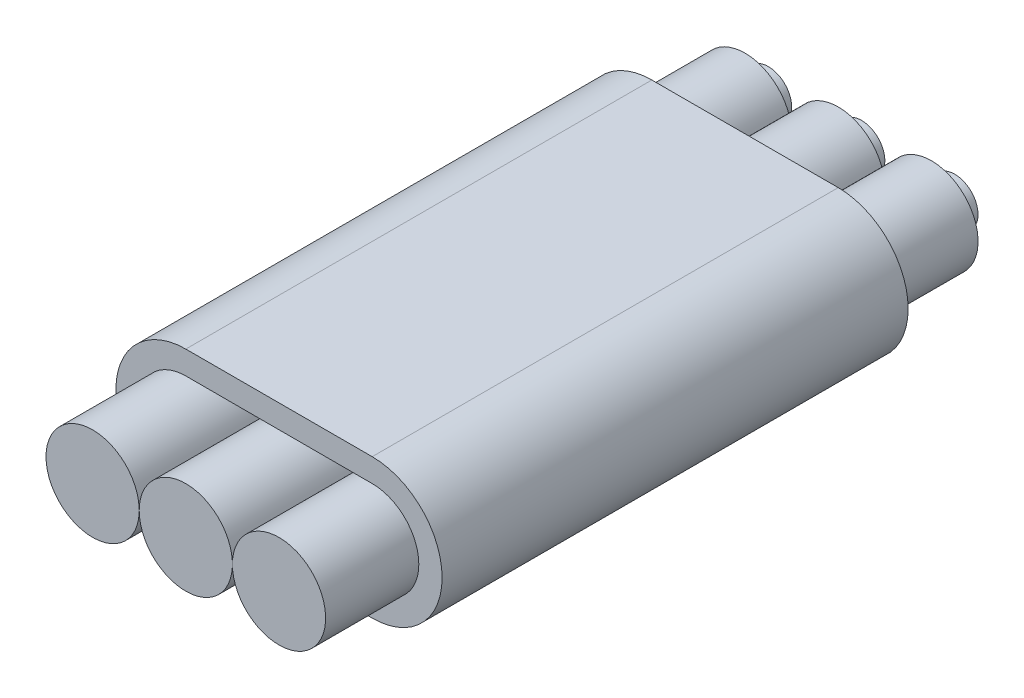
ISO-10303-21;
HEADER;
FILE_DESCRIPTION(('STEP AP214'),'2;1');
FILE_NAME('part.step','',(''),(''),'','','');
FILE_SCHEMA(('AUTOMOTIVE_DESIGN { 1 0 10303 214 1 1 1 1 }'));
ENDSEC;
DATA;
#1=APPLICATION_CONTEXT('core data for automotive mechanical design processes');
#2=APPLICATION_PROTOCOL_DEFINITION('international standard','automotive_design',2000,#1);
#3=PRODUCT_CONTEXT('',#1,'mechanical');
#4=PRODUCT('Part','Part','',(#3));
#5=PRODUCT_RELATED_PRODUCT_CATEGORY('part','',(#4));
#6=PRODUCT_DEFINITION_FORMATION('','',#4);
#7=PRODUCT_DEFINITION_CONTEXT('part definition',#1,'design');
#8=PRODUCT_DEFINITION('design','',#6,#7);
#9=PRODUCT_DEFINITION_SHAPE('','',#8);
#10=(LENGTH_UNIT() NAMED_UNIT(*) SI_UNIT(.MILLI.,.METRE.));
#11=(NAMED_UNIT(*) PLANE_ANGLE_UNIT() SI_UNIT($,.RADIAN.));
#12=(NAMED_UNIT(*) SI_UNIT($,.STERADIAN.) SOLID_ANGLE_UNIT());
#13=UNCERTAINTY_MEASURE_WITH_UNIT(LENGTH_MEASURE(1.E-05),#10,'distance_accuracy_value','');
#14=(GEOMETRIC_REPRESENTATION_CONTEXT(3) GLOBAL_UNCERTAINTY_ASSIGNED_CONTEXT((#13)) GLOBAL_UNIT_ASSIGNED_CONTEXT((#10,
#11,#12)) REPRESENTATION_CONTEXT('',''));
#15=CARTESIAN_POINT('',(0.,0.,0.));
#16=DIRECTION('',(0.,0.,1.));
#17=DIRECTION('',(1.,0.,0.));
#18=AXIS2_PLACEMENT_3D('',#15,#16,#17);
#19=CARTESIAN_POINT('',(0.,0.,12.));
#20=DIRECTION('',(0.,0.,-1.));
#21=DIRECTION('',(-1.,0.,0.));
#22=AXIS2_PLACEMENT_3D('',#19,#20,#21);
#23=CYLINDRICAL_SURFACE('',#22,1.);
#24=CARTESIAN_POINT('',(0.,0.,12.));
#25=DIRECTION('',(0.,0.,-1.));
#26=DIRECTION('',(-1.,0.,0.));
#27=AXIS2_PLACEMENT_3D('',#24,#25,#26);
#28=CIRCLE('',#27,1.);
#29=CARTESIAN_POINT('',(-1.,0.,12.));
#30=VERTEX_POINT('',#29);
#31=EDGE_CURVE('E126',#30,#30,#28,.T.);
#32=ORIENTED_EDGE('',*,*,#31,.T.);
#33=EDGE_LOOP('',(#32));
#34=FACE_BOUND('',#33,.T.);
#35=CARTESIAN_POINT('',(0.,0.,-2.));
#36=DIRECTION('',(0.,0.,-1.));
#37=DIRECTION('',(-1.,0.,0.));
#38=AXIS2_PLACEMENT_3D('',#35,#36,#37);
#39=CIRCLE('',#38,1.);
#40=CARTESIAN_POINT('',(-1.,0.,-2.));
#41=VERTEX_POINT('',#40);
#42=EDGE_CURVE('E122',#41,#41,#39,.T.);
#43=ORIENTED_EDGE('',*,*,#42,.F.);
#44=EDGE_LOOP('',(#43));
#45=FACE_BOUND('',#44,.T.);
#46=ADVANCED_FACE('F115',(#34,#45),#23,.T.);
#47=CARTESIAN_POINT('',(0.,0.,-2.));
#48=DIRECTION('',(0.,0.,-1.));
#49=DIRECTION('',(-1.,0.,0.));
#50=AXIS2_PLACEMENT_3D('',#47,#48,#49);
#51=PLANE('',#50);
#52=ORIENTED_EDGE('',*,*,#42,.T.);
#53=EDGE_LOOP('',(#52));
#54=FACE_BOUND('',#53,.T.);
#55=CARTESIAN_POINT('',(0.,0.,-2.));
#56=DIRECTION('',(0.,0.,-1.));
#57=DIRECTION('',(-1.,0.,0.));
#58=AXIS2_PLACEMENT_3D('',#55,#56,#57);
#59=CIRCLE('',#58,0.5);
#60=CARTESIAN_POINT('',(-0.5,0.,-2.));
#61=VERTEX_POINT('',#60);
#62=EDGE_CURVE('E12',#61,#61,#59,.T.);
#63=ORIENTED_EDGE('',*,*,#62,.F.);
#64=EDGE_LOOP('',(#63));
#65=FACE_BOUND('',#64,.T.);
#66=ADVANCED_FACE('F117',(#54,#65),#51,.T.);
#67=CARTESIAN_POINT('',(0.,0.,12.));
#68=DIRECTION('',(0.,0.,-1.));
#69=DIRECTION('',(-1.,0.,0.));
#70=AXIS2_PLACEMENT_3D('',#67,#68,#69);
#71=PLANE('',#70);
#72=ORIENTED_EDGE('',*,*,#31,.F.);
#73=EDGE_LOOP('',(#72));
#74=FACE_BOUND('',#73,.T.);
#75=ADVANCED_FACE('F140',(#74),#71,.F.);
#76=CARTESIAN_POINT('',(0.,0.,13.4142135623731));
#77=DIRECTION('',(0.,0.,-1.));
#78=DIRECTION('',(-1.,0.,0.));
#79=AXIS2_PLACEMENT_3D('',#76,#77,#78);
#80=CYLINDRICAL_SURFACE('',#79,0.5);
#81=ORIENTED_EDGE('',*,*,#62,.T.);
#82=EDGE_LOOP('',(#81));
#83=FACE_BOUND('',#82,.T.);
#84=CARTESIAN_POINT('',(0.,0.,-2.5));
#85=DIRECTION('',(0.,0.,-1.));
#86=DIRECTION('',(-1.,0.,0.));
#87=AXIS2_PLACEMENT_3D('',#84,#85,#86);
#88=CIRCLE('',#87,0.5);
#89=CARTESIAN_POINT('',(-0.5,0.,-2.5));
#90=VERTEX_POINT('',#89);
#91=EDGE_CURVE('E130',#90,#90,#88,.T.);
#92=ORIENTED_EDGE('',*,*,#91,.F.);
#93=EDGE_LOOP('',(#92));
#94=FACE_BOUND('',#93,.T.);
#95=ADVANCED_FACE('F138',(#83,#94),#80,.T.);
#96=CARTESIAN_POINT('',(0.,0.,-2.5));
#97=DIRECTION('',(0.,0.,-1.));
#98=DIRECTION('',(-1.,0.,0.));
#99=AXIS2_PLACEMENT_3D('',#96,#97,#98);
#100=PLANE('',#99);
#101=ORIENTED_EDGE('',*,*,#91,.T.);
#102=EDGE_LOOP('',(#101));
#103=FACE_BOUND('',#102,.T.);
#104=ADVANCED_FACE('F136',(#103),#100,.T.);
#105=CLOSED_SHELL('',(#46,#66,#75,#95,#104));
#106=MANIFOLD_SOLID_BREP('B2',#105);
#107=CARTESIAN_POINT('',(-2.,0.,10.));
#108=DIRECTION('',(0.,0.,1.));
#109=DIRECTION('',(1.,0.,0.));
#110=AXIS2_PLACEMENT_3D('',#107,#108,#109);
#111=PLANE('',#110);
#112=CARTESIAN_POINT('',(-2.,0.,10.));
#113=DIRECTION('',(0.,0.,1.));
#114=DIRECTION('',(1.,0.,0.));
#115=AXIS2_PLACEMENT_3D('',#112,#113,#114);
#116=CIRCLE('',#115,1.5);
#117=CARTESIAN_POINT('',(-2.,1.5,10.));
#118=VERTEX_POINT('',#117);
#119=CARTESIAN_POINT('',(-2.,-1.5,10.));
#120=VERTEX_POINT('',#119);
#121=EDGE_CURVE('E289',#118,#120,#116,.T.);
#122=ORIENTED_EDGE('',*,*,#121,.T.);
#123=DIRECTION('',(1.,0.,0.));
#124=VECTOR('',#123,1.);
#125=CARTESIAN_POINT('',(-2.,-1.5,10.));
#126=LINE('',#125,#124);
#127=CARTESIAN_POINT('',(2.,-1.5,10.));
#128=VERTEX_POINT('',#127);
#129=EDGE_CURVE('E292',#120,#128,#126,.T.);
#130=ORIENTED_EDGE('',*,*,#129,.T.);
#131=CARTESIAN_POINT('',(2.,0.,10.));
#132=DIRECTION('',(0.,0.,1.));
#133=DIRECTION('',(1.,0.,0.));
#134=AXIS2_PLACEMENT_3D('',#131,#132,#133);
#135=CIRCLE('',#134,1.5);
#136=CARTESIAN_POINT('',(2.,1.5,10.));
#137=VERTEX_POINT('',#136);
#138=EDGE_CURVE('E295',#128,#137,#135,.T.);
#139=ORIENTED_EDGE('',*,*,#138,.T.);
#140=DIRECTION('',(-1.,0.,0.));
#141=VECTOR('',#140,1.);
#142=CARTESIAN_POINT('',(-2.,1.5,10.));
#143=LINE('',#142,#141);
#144=EDGE_CURVE('E297',#137,#118,#143,.T.);
#145=ORIENTED_EDGE('',*,*,#144,.T.);
#146=EDGE_LOOP('',(#122,#130,#139,#145));
#147=FACE_BOUND('',#146,.T.);
#148=DIRECTION('',(1.,0.,0.));
#149=VECTOR('',#148,1.);
#150=CARTESIAN_POINT('',(-2.,-1.,10.));
#151=LINE('',#150,#149);
#152=CARTESIAN_POINT('',(-2.,-1.,10.));
#153=VERTEX_POINT('',#152);
#154=CARTESIAN_POINT('',(2.,-1.,10.));
#155=VERTEX_POINT('',#154);
#156=EDGE_CURVE('E359',#153,#155,#151,.T.);
#157=ORIENTED_EDGE('',*,*,#156,.F.);
#158=CARTESIAN_POINT('',(-2.,0.,10.));
#159=DIRECTION('',(0.,0.,1.));
#160=DIRECTION('',(1.,0.,0.));
#161=AXIS2_PLACEMENT_3D('',#158,#159,#160);
#162=CIRCLE('',#161,1.);
#163=CARTESIAN_POINT('',(-2.,1.,10.));
#164=VERTEX_POINT('',#163);
#165=EDGE_CURVE('E274',#164,#153,#162,.T.);
#166=ORIENTED_EDGE('',*,*,#165,.F.);
#167=DIRECTION('',(-1.,0.,0.));
#168=VECTOR('',#167,1.);
#169=CARTESIAN_POINT('',(-2.,1.,10.));
#170=LINE('',#169,#168);
#171=CARTESIAN_POINT('',(2.,1.,10.));
#172=VERTEX_POINT('',#171);
#173=EDGE_CURVE('E284',#172,#164,#170,.T.);
#174=ORIENTED_EDGE('',*,*,#173,.F.);
#175=CARTESIAN_POINT('',(2.,0.,10.));
#176=DIRECTION('',(0.,0.,1.));
#177=DIRECTION('',(1.,0.,0.));
#178=AXIS2_PLACEMENT_3D('',#175,#176,#177);
#179=CIRCLE('',#178,1.);
#180=EDGE_CURVE('E279',#155,#172,#179,.T.);
#181=ORIENTED_EDGE('',*,*,#180,.F.);
#182=EDGE_LOOP('',(#157,#166,#174,#181));
#183=FACE_BOUND('',#182,.T.);
#184=ADVANCED_FACE('F198',(#147,#183),#111,.T.);
#185=CARTESIAN_POINT('',(-2.,0.,0.));
#186=DIRECTION('',(0.,0.,1.));
#187=DIRECTION('',(1.,0.,0.));
#188=AXIS2_PLACEMENT_3D('',#185,#186,#187);
#189=PLANE('',#188);
#190=CARTESIAN_POINT('',(-2.,0.,0.));
#191=DIRECTION('',(0.,0.,1.));
#192=DIRECTION('',(1.,0.,0.));
#193=AXIS2_PLACEMENT_3D('',#190,#191,#192);
#194=CIRCLE('',#193,1.5);
#195=CARTESIAN_POINT('',(-2.,1.5,0.));
#196=VERTEX_POINT('',#195);
#197=CARTESIAN_POINT('',(-2.,-1.5,0.));
#198=VERTEX_POINT('',#197);
#199=EDGE_CURVE('E288',#196,#198,#194,.T.);
#200=ORIENTED_EDGE('',*,*,#199,.F.);
#201=DIRECTION('',(-1.,0.,0.));
#202=VECTOR('',#201,1.);
#203=CARTESIAN_POINT('',(-2.,1.5,0.));
#204=LINE('',#203,#202);
#205=CARTESIAN_POINT('',(2.,1.5,0.));
#206=VERTEX_POINT('',#205);
#207=EDGE_CURVE('E293',#206,#196,#204,.T.);
#208=ORIENTED_EDGE('',*,*,#207,.F.);
#209=CARTESIAN_POINT('',(2.,0.,0.));
#210=DIRECTION('',(0.,0.,1.));
#211=DIRECTION('',(1.,0.,0.));
#212=AXIS2_PLACEMENT_3D('',#209,#210,#211);
#213=CIRCLE('',#212,1.5);
#214=CARTESIAN_POINT('',(2.,-1.5,0.));
#215=VERTEX_POINT('',#214);
#216=EDGE_CURVE('E304',#215,#206,#213,.T.);
#217=ORIENTED_EDGE('',*,*,#216,.F.);
#218=DIRECTION('',(1.,0.,0.));
#219=VECTOR('',#218,1.);
#220=CARTESIAN_POINT('',(-2.,-1.5,0.));
#221=LINE('',#220,#219);
#222=EDGE_CURVE('E302',#198,#215,#221,.T.);
#223=ORIENTED_EDGE('',*,*,#222,.F.);
#224=EDGE_LOOP('',(#200,#208,#217,#223));
#225=FACE_BOUND('',#224,.T.);
#226=CARTESIAN_POINT('',(-2.,0.,0.));
#227=DIRECTION('',(0.,0.,1.));
#228=DIRECTION('',(1.,0.,0.));
#229=AXIS2_PLACEMENT_3D('',#226,#227,#228);
#230=CIRCLE('',#229,1.);
#231=CARTESIAN_POINT('',(-2.,1.,0.));
#232=VERTEX_POINT('',#231);
#233=CARTESIAN_POINT('',(-2.,-1.,0.));
#234=VERTEX_POINT('',#233);
#235=EDGE_CURVE('E366',#232,#234,#230,.T.);
#236=ORIENTED_EDGE('',*,*,#235,.T.);
#237=DIRECTION('',(1.,0.,0.));
#238=VECTOR('',#237,1.);
#239=CARTESIAN_POINT('',(-2.,-1.,0.));
#240=LINE('',#239,#238);
#241=CARTESIAN_POINT('',(2.,-1.,0.));
#242=VERTEX_POINT('',#241);
#243=EDGE_CURVE('E265',#234,#242,#240,.T.);
#244=ORIENTED_EDGE('',*,*,#243,.T.);
#245=CARTESIAN_POINT('',(2.,0.,0.));
#246=DIRECTION('',(0.,0.,1.));
#247=DIRECTION('',(1.,0.,0.));
#248=AXIS2_PLACEMENT_3D('',#245,#246,#247);
#249=CIRCLE('',#248,1.);
#250=CARTESIAN_POINT('',(2.,1.,0.));
#251=VERTEX_POINT('',#250);
#252=EDGE_CURVE('E262',#242,#251,#249,.T.);
#253=ORIENTED_EDGE('',*,*,#252,.T.);
#254=DIRECTION('',(-1.,0.,0.));
#255=VECTOR('',#254,1.);
#256=CARTESIAN_POINT('',(-2.,1.,0.));
#257=LINE('',#256,#255);
#258=EDGE_CURVE('E220',#251,#232,#257,.T.);
#259=ORIENTED_EDGE('',*,*,#258,.T.);
#260=EDGE_LOOP('',(#236,#244,#253,#259));
#261=FACE_BOUND('',#260,.T.);
#262=ADVANCED_FACE('F263',(#225,#261),#189,.F.);
#263=CARTESIAN_POINT('',(-2.,0.,10.));
#264=DIRECTION('',(0.,0.,-1.));
#265=DIRECTION('',(-1.,0.,0.));
#266=AXIS2_PLACEMENT_3D('',#263,#264,#265);
#267=CYLINDRICAL_SURFACE('',#266,1.5);
#268=ORIENTED_EDGE('',*,*,#199,.T.);
#269=DIRECTION('',(0.,0.,-1.));
#270=VECTOR('',#269,1.);
#271=CARTESIAN_POINT('',(-2.,-1.5,10.));
#272=LINE('',#271,#270);
#273=EDGE_CURVE('E113',#120,#198,#272,.T.);
#274=ORIENTED_EDGE('',*,*,#273,.F.);
#275=ORIENTED_EDGE('',*,*,#121,.F.);
#276=DIRECTION('',(0.,0.,-1.));
#277=VECTOR('',#276,1.);
#278=CARTESIAN_POINT('',(-2.,1.5,10.));
#279=LINE('',#278,#277);
#280=EDGE_CURVE('E299',#118,#196,#279,.T.);
#281=ORIENTED_EDGE('',*,*,#280,.T.);
#282=EDGE_LOOP('',(#268,#274,#275,#281));
#283=FACE_BOUND('',#282,.T.);
#284=ADVANCED_FACE('F200',(#283),#267,.T.);
#285=CARTESIAN_POINT('',(-2.,-1.5,10.));
#286=DIRECTION('',(0.,1.,0.));
#287=DIRECTION('',(-1.,0.,0.));
#288=AXIS2_PLACEMENT_3D('',#285,#286,#287);
#289=PLANE('',#288);
#290=ORIENTED_EDGE('',*,*,#222,.T.);
#291=DIRECTION('',(0.,0.,-1.));
#292=VECTOR('',#291,1.);
#293=CARTESIAN_POINT('',(2.,-1.5,10.));
#294=LINE('',#293,#292);
#295=EDGE_CURVE('E206',#128,#215,#294,.T.);
#296=ORIENTED_EDGE('',*,*,#295,.F.);
#297=ORIENTED_EDGE('',*,*,#129,.F.);
#298=ORIENTED_EDGE('',*,*,#273,.T.);
#299=EDGE_LOOP('',(#290,#296,#297,#298));
#300=FACE_BOUND('',#299,.T.);
#301=ADVANCED_FACE('F331',(#300),#289,.F.);
#302=CARTESIAN_POINT('',(2.,0.,10.));
#303=DIRECTION('',(0.,0.,-1.));
#304=DIRECTION('',(-1.,0.,0.));
#305=AXIS2_PLACEMENT_3D('',#302,#303,#304);
#306=CYLINDRICAL_SURFACE('',#305,1.5);
#307=ORIENTED_EDGE('',*,*,#216,.T.);
#308=DIRECTION('',(0.,0.,-1.));
#309=VECTOR('',#308,1.);
#310=CARTESIAN_POINT('',(2.,1.5,10.));
#311=LINE('',#310,#309);
#312=EDGE_CURVE('E309',#137,#206,#311,.T.);
#313=ORIENTED_EDGE('',*,*,#312,.F.);
#314=ORIENTED_EDGE('',*,*,#138,.F.);
#315=ORIENTED_EDGE('',*,*,#295,.T.);
#316=EDGE_LOOP('',(#307,#313,#314,#315));
#317=FACE_BOUND('',#316,.T.);
#318=ADVANCED_FACE('F316',(#317),#306,.T.);
#319=CARTESIAN_POINT('',(-2.,1.5,10.));
#320=DIRECTION('',(0.,-1.,0.));
#321=DIRECTION('',(1.,0.,0.));
#322=AXIS2_PLACEMENT_3D('',#319,#320,#321);
#323=PLANE('',#322);
#324=ORIENTED_EDGE('',*,*,#207,.T.);
#325=ORIENTED_EDGE('',*,*,#280,.F.);
#326=ORIENTED_EDGE('',*,*,#144,.F.);
#327=ORIENTED_EDGE('',*,*,#312,.T.);
#328=EDGE_LOOP('',(#324,#325,#326,#327));
#329=FACE_BOUND('',#328,.T.);
#330=ADVANCED_FACE('F324',(#329),#323,.F.);
#331=CARTESIAN_POINT('',(-2.,-1.,10.));
#332=DIRECTION('',(0.,1.,0.));
#333=DIRECTION('',(-1.,0.,0.));
#334=AXIS2_PLACEMENT_3D('',#331,#332,#333);
#335=PLANE('',#334);
#336=DIRECTION('',(0.,0.,-1.));
#337=VECTOR('',#336,1.);
#338=CARTESIAN_POINT('',(2.,-1.,10.));
#339=LINE('',#338,#337);
#340=EDGE_CURVE('E280',#155,#242,#339,.T.);
#341=ORIENTED_EDGE('',*,*,#340,.T.);
#342=ORIENTED_EDGE('',*,*,#243,.F.);
#343=DIRECTION('',(0.,0.,-1.));
#344=VECTOR('',#343,1.);
#345=CARTESIAN_POINT('',(-2.,-1.,10.));
#346=LINE('',#345,#344);
#347=EDGE_CURVE('E282',#153,#234,#346,.T.);
#348=ORIENTED_EDGE('',*,*,#347,.F.);
#349=ORIENTED_EDGE('',*,*,#156,.T.);
#350=EDGE_LOOP('',(#341,#342,#348,#349));
#351=FACE_BOUND('',#350,.T.);
#352=ADVANCED_FACE('F345',(#351),#335,.T.);
#353=CARTESIAN_POINT('',(-2.,1.,10.));
#354=DIRECTION('',(0.,-1.,0.));
#355=DIRECTION('',(1.,0.,0.));
#356=AXIS2_PLACEMENT_3D('',#353,#354,#355);
#357=PLANE('',#356);
#358=DIRECTION('',(0.,0.,-1.));
#359=VECTOR('',#358,1.);
#360=CARTESIAN_POINT('',(-2.,1.,10.));
#361=LINE('',#360,#359);
#362=EDGE_CURVE('E273',#164,#232,#361,.T.);
#363=ORIENTED_EDGE('',*,*,#362,.T.);
#364=ORIENTED_EDGE('',*,*,#258,.F.);
#365=DIRECTION('',(0.,0.,-1.));
#366=VECTOR('',#365,1.);
#367=CARTESIAN_POINT('',(2.,1.,10.));
#368=LINE('',#367,#366);
#369=EDGE_CURVE('E213',#172,#251,#368,.T.);
#370=ORIENTED_EDGE('',*,*,#369,.F.);
#371=ORIENTED_EDGE('',*,*,#173,.T.);
#372=EDGE_LOOP('',(#363,#364,#370,#371));
#373=FACE_BOUND('',#372,.T.);
#374=ADVANCED_FACE('F271',(#373),#357,.T.);
#375=CARTESIAN_POINT('',(-2.,0.,-2.));
#376=DIRECTION('',(0.,0.,1.));
#377=DIRECTION('',(1.,0.,0.));
#378=AXIS2_PLACEMENT_3D('',#375,#376,#377);
#379=CYLINDRICAL_SURFACE('',#378,1.);
#380=CARTESIAN_POINT('',(-2.,0.,-2.));
#381=DIRECTION('',(0.,0.,-1.));
#382=DIRECTION('',(-1.,0.,0.));
#383=AXIS2_PLACEMENT_3D('',#380,#381,#382);
#384=CIRCLE('',#383,1.);
#385=CARTESIAN_POINT('',(-3.,0.,-2.));
#386=VERTEX_POINT('',#385);
#387=EDGE_CURVE('E368',#386,#386,#384,.T.);
#388=ORIENTED_EDGE('',*,*,#387,.F.);
#389=EDGE_LOOP('',(#388));
#390=FACE_BOUND('',#389,.T.);
#391=CARTESIAN_POINT('',(-2.,0.,12.));
#392=DIRECTION('',(0.,0.,-1.));
#393=DIRECTION('',(-1.,0.,0.));
#394=AXIS2_PLACEMENT_3D('',#391,#392,#393);
#395=CIRCLE('',#394,1.);
#396=CARTESIAN_POINT('',(-3.,0.,12.));
#397=VERTEX_POINT('',#396);
#398=EDGE_CURVE('E375',#397,#397,#395,.T.);
#399=ORIENTED_EDGE('',*,*,#398,.T.);
#400=EDGE_LOOP('',(#399));
#401=FACE_BOUND('',#400,.T.);
#402=ORIENTED_EDGE('',*,*,#165,.T.);
#403=ORIENTED_EDGE('',*,*,#347,.T.);
#404=ORIENTED_EDGE('',*,*,#235,.F.);
#405=ORIENTED_EDGE('',*,*,#362,.F.);
#406=EDGE_LOOP('',(#402,#403,#404,#405));
#407=FACE_BOUND('',#406,.T.);
#408=ADVANCED_FACE('F356',(#390,#401,#407),#379,.T.);
#409=CARTESIAN_POINT('',(-2.,0.,-2.));
#410=DIRECTION('',(0.,0.,-1.));
#411=DIRECTION('',(-1.,0.,0.));
#412=AXIS2_PLACEMENT_3D('',#409,#410,#411);
#413=PLANE('',#412);
#414=ORIENTED_EDGE('',*,*,#387,.T.);
#415=EDGE_LOOP('',(#414));
#416=FACE_BOUND('',#415,.T.);
#417=CARTESIAN_POINT('',(-2.,0.,-2.));
#418=DIRECTION('',(0.,0.,-1.));
#419=DIRECTION('',(-1.,0.,0.));
#420=AXIS2_PLACEMENT_3D('',#417,#418,#419);
#421=CIRCLE('',#420,0.5);
#422=CARTESIAN_POINT('',(-2.5,0.,-2.));
#423=VERTEX_POINT('',#422);
#424=EDGE_CURVE('E370',#423,#423,#421,.T.);
#425=ORIENTED_EDGE('',*,*,#424,.F.);
#426=EDGE_LOOP('',(#425));
#427=FACE_BOUND('',#426,.T.);
#428=ADVANCED_FACE('F383',(#416,#427),#413,.T.);
#429=CARTESIAN_POINT('',(-2.,0.,12.));
#430=DIRECTION('',(0.,0.,-1.));
#431=DIRECTION('',(-1.,0.,0.));
#432=AXIS2_PLACEMENT_3D('',#429,#430,#431);
#433=PLANE('',#432);
#434=ORIENTED_EDGE('',*,*,#398,.F.);
#435=EDGE_LOOP('',(#434));
#436=FACE_BOUND('',#435,.T.);
#437=ADVANCED_FACE('F386',(#436),#433,.F.);
#438=CARTESIAN_POINT('',(2.,0.,12.));
#439=DIRECTION('',(0.,0.,-1.));
#440=DIRECTION('',(-1.,0.,0.));
#441=AXIS2_PLACEMENT_3D('',#438,#439,#440);
#442=CYLINDRICAL_SURFACE('',#441,1.);
#443=CARTESIAN_POINT('',(2.,0.,-2.));
#444=DIRECTION('',(0.,0.,-1.));
#445=DIRECTION('',(-1.,0.,0.));
#446=AXIS2_PLACEMENT_3D('',#443,#444,#445);
#447=CIRCLE('',#446,1.);
#448=CARTESIAN_POINT('',(1.,0.,-2.));
#449=VERTEX_POINT('',#448);
#450=EDGE_CURVE('E423',#449,#449,#447,.T.);
#451=ORIENTED_EDGE('',*,*,#450,.F.);
#452=EDGE_LOOP('',(#451));
#453=FACE_BOUND('',#452,.T.);
#454=CARTESIAN_POINT('',(2.,0.,12.));
#455=DIRECTION('',(0.,0.,-1.));
#456=DIRECTION('',(-1.,0.,0.));
#457=AXIS2_PLACEMENT_3D('',#454,#455,#456);
#458=CIRCLE('',#457,1.);
#459=CARTESIAN_POINT('',(1.,0.,12.));
#460=VERTEX_POINT('',#459);
#461=EDGE_CURVE('E427',#460,#460,#458,.T.);
#462=ORIENTED_EDGE('',*,*,#461,.T.);
#463=EDGE_LOOP('',(#462));
#464=FACE_BOUND('',#463,.T.);
#465=ORIENTED_EDGE('',*,*,#340,.F.);
#466=ORIENTED_EDGE('',*,*,#180,.T.);
#467=ORIENTED_EDGE('',*,*,#369,.T.);
#468=ORIENTED_EDGE('',*,*,#252,.F.);
#469=EDGE_LOOP('',(#465,#466,#467,#468));
#470=FACE_BOUND('',#469,.T.);
#471=ADVANCED_FACE('F277',(#453,#464,#470),#442,.T.);
#472=CARTESIAN_POINT('',(2.,0.,12.));
#473=DIRECTION('',(0.,0.,-1.));
#474=DIRECTION('',(-1.,0.,0.));
#475=AXIS2_PLACEMENT_3D('',#472,#473,#474);
#476=PLANE('',#475);
#477=ORIENTED_EDGE('',*,*,#461,.F.);
#478=EDGE_LOOP('',(#477));
#479=FACE_BOUND('',#478,.T.);
#480=ADVANCED_FACE('F398',(#479),#476,.F.);
#481=CARTESIAN_POINT('',(2.,0.,-2.));
#482=DIRECTION('',(0.,0.,-1.));
#483=DIRECTION('',(-1.,0.,0.));
#484=AXIS2_PLACEMENT_3D('',#481,#482,#483);
#485=PLANE('',#484);
#486=ORIENTED_EDGE('',*,*,#450,.T.);
#487=EDGE_LOOP('',(#486));
#488=FACE_BOUND('',#487,.T.);
#489=CARTESIAN_POINT('',(2.,0.,-2.));
#490=DIRECTION('',(0.,0.,-1.));
#491=DIRECTION('',(-1.,0.,0.));
#492=AXIS2_PLACEMENT_3D('',#489,#490,#491);
#493=CIRCLE('',#492,0.5);
#494=CARTESIAN_POINT('',(1.5,0.,-2.));
#495=VERTEX_POINT('',#494);
#496=EDGE_CURVE('E380',#495,#495,#493,.T.);
#497=ORIENTED_EDGE('',*,*,#496,.F.);
#498=EDGE_LOOP('',(#497));
#499=FACE_BOUND('',#498,.T.);
#500=ADVANCED_FACE('F405',(#488,#499),#485,.T.);
#501=CARTESIAN_POINT('',(2.,0.,-2.5));
#502=DIRECTION('',(0.,0.,-1.));
#503=DIRECTION('',(-1.,0.,0.));
#504=AXIS2_PLACEMENT_3D('',#501,#502,#503);
#505=PLANE('',#504);
#506=CARTESIAN_POINT('',(2.,0.,-2.5));
#507=DIRECTION('',(0.,0.,-1.));
#508=DIRECTION('',(-1.,0.,0.));
#509=AXIS2_PLACEMENT_3D('',#506,#507,#508);
#510=CIRCLE('',#509,0.5);
#511=CARTESIAN_POINT('',(1.5,0.,-2.5));
#512=VERTEX_POINT('',#511);
#513=EDGE_CURVE('E432',#512,#512,#510,.T.);
#514=ORIENTED_EDGE('',*,*,#513,.T.);
#515=EDGE_LOOP('',(#514));
#516=FACE_BOUND('',#515,.T.);
#517=ADVANCED_FACE('F415',(#516),#505,.T.);
#518=CARTESIAN_POINT('',(2.,0.,13.4142135623731));
#519=DIRECTION('',(0.,0.,-1.));
#520=DIRECTION('',(-1.,0.,0.));
#521=AXIS2_PLACEMENT_3D('',#518,#519,#520);
#522=CYLINDRICAL_SURFACE('',#521,0.5);
#523=ORIENTED_EDGE('',*,*,#496,.T.);
#524=EDGE_LOOP('',(#523));
#525=FACE_BOUND('',#524,.T.);
#526=ORIENTED_EDGE('',*,*,#513,.F.);
#527=EDGE_LOOP('',(#526));
#528=FACE_BOUND('',#527,.T.);
#529=ADVANCED_FACE('F411',(#525,#528),#522,.T.);
#530=CARTESIAN_POINT('',(-2.,0.,13.4142135623731));
#531=DIRECTION('',(0.,0.,-1.));
#532=DIRECTION('',(-1.,0.,0.));
#533=AXIS2_PLACEMENT_3D('',#530,#531,#532);
#534=CYLINDRICAL_SURFACE('',#533,0.5);
#535=ORIENTED_EDGE('',*,*,#424,.T.);
#536=EDGE_LOOP('',(#535));
#537=FACE_BOUND('',#536,.T.);
#538=CARTESIAN_POINT('',(-2.,0.,-2.5));
#539=DIRECTION('',(0.,0.,-1.));
#540=DIRECTION('',(-1.,0.,0.));
#541=AXIS2_PLACEMENT_3D('',#538,#539,#540);
#542=CIRCLE('',#541,0.5);
#543=CARTESIAN_POINT('',(-2.5,0.,-2.5));
#544=VERTEX_POINT('',#543);
#545=EDGE_CURVE('E435',#544,#544,#542,.T.);
#546=ORIENTED_EDGE('',*,*,#545,.F.);
#547=EDGE_LOOP('',(#546));
#548=FACE_BOUND('',#547,.T.);
#549=ADVANCED_FACE('F441',(#537,#548),#534,.T.);
#550=CARTESIAN_POINT('',(-2.,0.,-2.5));
#551=DIRECTION('',(0.,0.,-1.));
#552=DIRECTION('',(-1.,0.,0.));
#553=AXIS2_PLACEMENT_3D('',#550,#551,#552);
#554=PLANE('',#553);
#555=ORIENTED_EDGE('',*,*,#545,.T.);
#556=EDGE_LOOP('',(#555));
#557=FACE_BOUND('',#556,.T.);
#558=ADVANCED_FACE('F439',(#557),#554,.T.);
#559=CLOSED_SHELL('',(#184,#262,#284,#301,#318,#330,#352,#374,#408,#428,#437,#471,#480,#500,
#517,#529,#549,#558));
#560=MANIFOLD_SOLID_BREP('B7',#559);
#561=ADVANCED_BREP_SHAPE_REPRESENTATION('',(#18,#106,#560),#14);
#562=SHAPE_DEFINITION_REPRESENTATION(#9,#561);
ENDSEC;
END-ISO-10303-21;
